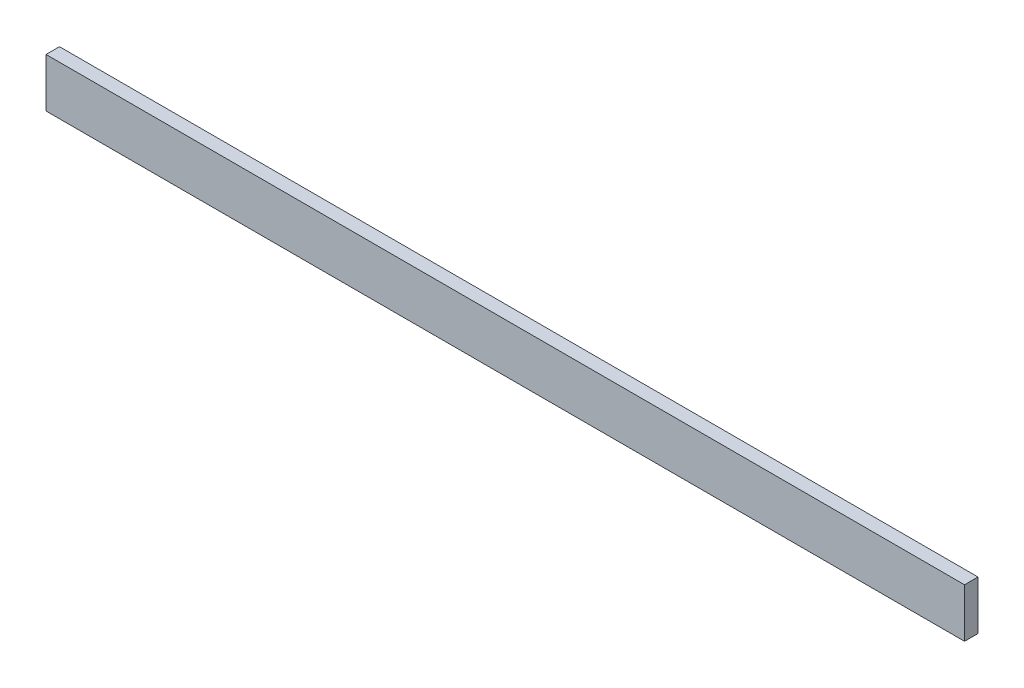
ISO-10303-21;
HEADER;
FILE_DESCRIPTION(('STEP AP214'),'2;1');
FILE_NAME('part.step','',(''),(''),'','','');
FILE_SCHEMA(('AUTOMOTIVE_DESIGN { 1 0 10303 214 1 1 1 1 }'));
ENDSEC;
DATA;
#1=APPLICATION_CONTEXT('core data for automotive mechanical design processes');
#2=APPLICATION_PROTOCOL_DEFINITION('international standard','automotive_design',2000,#1);
#3=PRODUCT_CONTEXT('',#1,'mechanical');
#4=PRODUCT('Part','Part','',(#3));
#5=PRODUCT_RELATED_PRODUCT_CATEGORY('part','',(#4));
#6=PRODUCT_DEFINITION_FORMATION('','',#4);
#7=PRODUCT_DEFINITION_CONTEXT('part definition',#1,'design');
#8=PRODUCT_DEFINITION('design','',#6,#7);
#9=PRODUCT_DEFINITION_SHAPE('','',#8);
#10=(LENGTH_UNIT() NAMED_UNIT(*) SI_UNIT(.MILLI.,.METRE.));
#11=(NAMED_UNIT(*) PLANE_ANGLE_UNIT() SI_UNIT($,.RADIAN.));
#12=(NAMED_UNIT(*) SI_UNIT($,.STERADIAN.) SOLID_ANGLE_UNIT());
#13=UNCERTAINTY_MEASURE_WITH_UNIT(LENGTH_MEASURE(1.E-05),#10,'distance_accuracy_value','');
#14=(GEOMETRIC_REPRESENTATION_CONTEXT(3) GLOBAL_UNCERTAINTY_ASSIGNED_CONTEXT((#13)) GLOBAL_UNIT_ASSIGNED_CONTEXT((#10,
#11,#12)) REPRESENTATION_CONTEXT('',''));
#15=CARTESIAN_POINT('',(0.,0.,0.));
#16=DIRECTION('',(0.,0.,1.));
#17=DIRECTION('',(1.,0.,0.));
#18=AXIS2_PLACEMENT_3D('',#15,#16,#17);
#19=CARTESIAN_POINT('',(0.,0.,22.));
#20=DIRECTION('',(1.,0.,0.));
#21=DIRECTION('',(0.,0.,-1.));
#22=AXIS2_PLACEMENT_3D('',#19,#20,#21);
#23=PLANE('',#22);
#24=DIRECTION('',(0.,-1.,0.));
#25=VECTOR('',#24,1.);
#26=CARTESIAN_POINT('',(0.,0.,0.));
#27=LINE('',#26,#25);
#28=CARTESIAN_POINT('',(0.,80.,0.));
#29=VERTEX_POINT('',#28);
#30=CARTESIAN_POINT('',(0.,0.,0.));
#31=VERTEX_POINT('',#30);
#32=EDGE_CURVE('E94',#29,#31,#27,.T.);
#33=ORIENTED_EDGE('',*,*,#32,.T.);
#34=DIRECTION('',(0.,0.,-1.));
#35=VECTOR('',#34,1.);
#36=CARTESIAN_POINT('',(0.,0.,22.));
#37=LINE('',#36,#35);
#38=CARTESIAN_POINT('',(0.,0.,22.));
#39=VERTEX_POINT('',#38);
#40=EDGE_CURVE('E11',#39,#31,#37,.T.);
#41=ORIENTED_EDGE('',*,*,#40,.F.);
#42=DIRECTION('',(0.,-1.,0.));
#43=VECTOR('',#42,1.);
#44=CARTESIAN_POINT('',(0.,0.,22.));
#45=LINE('',#44,#43);
#46=CARTESIAN_POINT('',(0.,80.,22.));
#47=VERTEX_POINT('',#46);
#48=EDGE_CURVE('E82',#47,#39,#45,.T.);
#49=ORIENTED_EDGE('',*,*,#48,.F.);
#50=DIRECTION('',(0.,0.,-1.));
#51=VECTOR('',#50,1.);
#52=CARTESIAN_POINT('',(0.,80.,22.));
#53=LINE('',#52,#51);
#54=EDGE_CURVE('E90',#47,#29,#53,.T.);
#55=ORIENTED_EDGE('',*,*,#54,.T.);
#56=EDGE_LOOP('',(#33,#41,#49,#55));
#57=FACE_BOUND('',#56,.T.);
#58=ADVANCED_FACE('F31',(#57),#23,.F.);
#59=CARTESIAN_POINT('',(0.,0.,22.));
#60=DIRECTION('',(0.,1.,0.));
#61=DIRECTION('',(0.,0.,1.));
#62=AXIS2_PLACEMENT_3D('',#59,#60,#61);
#63=PLANE('',#62);
#64=DIRECTION('',(1.,0.,0.));
#65=VECTOR('',#64,1.);
#66=CARTESIAN_POINT('',(0.,0.,0.));
#67=LINE('',#66,#65);
#68=CARTESIAN_POINT('',(1500.,0.,0.));
#69=VERTEX_POINT('',#68);
#70=EDGE_CURVE('E86',#31,#69,#67,.T.);
#71=ORIENTED_EDGE('',*,*,#70,.T.);
#72=DIRECTION('',(0.,0.,-1.));
#73=VECTOR('',#72,1.);
#74=CARTESIAN_POINT('',(1500.,0.,22.));
#75=LINE('',#74,#73);
#76=CARTESIAN_POINT('',(1500.,0.,22.));
#77=VERTEX_POINT('',#76);
#78=EDGE_CURVE('E39',#77,#69,#75,.T.);
#79=ORIENTED_EDGE('',*,*,#78,.F.);
#80=DIRECTION('',(1.,0.,0.));
#81=VECTOR('',#80,1.);
#82=CARTESIAN_POINT('',(0.,0.,22.));
#83=LINE('',#82,#81);
#84=EDGE_CURVE('E77',#39,#77,#83,.T.);
#85=ORIENTED_EDGE('',*,*,#84,.F.);
#86=ORIENTED_EDGE('',*,*,#40,.T.);
#87=EDGE_LOOP('',(#71,#79,#85,#86));
#88=FACE_BOUND('',#87,.T.);
#89=ADVANCED_FACE('F85',(#88),#63,.F.);
#90=CARTESIAN_POINT('',(1500.,0.,22.));
#91=DIRECTION('',(-1.,0.,0.));
#92=DIRECTION('',(0.,0.,1.));
#93=AXIS2_PLACEMENT_3D('',#90,#91,#92);
#94=PLANE('',#93);
#95=DIRECTION('',(0.,1.,0.));
#96=VECTOR('',#95,1.);
#97=CARTESIAN_POINT('',(1500.,0.,0.));
#98=LINE('',#97,#96);
#99=CARTESIAN_POINT('',(1500.,80.,0.));
#100=VERTEX_POINT('',#99);
#101=EDGE_CURVE('E64',#69,#100,#98,.T.);
#102=ORIENTED_EDGE('',*,*,#101,.T.);
#103=DIRECTION('',(0.,0.,-1.));
#104=VECTOR('',#103,1.);
#105=CARTESIAN_POINT('',(1500.,80.,22.));
#106=LINE('',#105,#104);
#107=CARTESIAN_POINT('',(1500.,80.,22.));
#108=VERTEX_POINT('',#107);
#109=EDGE_CURVE('E87',#108,#100,#106,.T.);
#110=ORIENTED_EDGE('',*,*,#109,.F.);
#111=DIRECTION('',(0.,1.,0.));
#112=VECTOR('',#111,1.);
#113=CARTESIAN_POINT('',(1500.,0.,22.));
#114=LINE('',#113,#112);
#115=EDGE_CURVE('E80',#77,#108,#114,.T.);
#116=ORIENTED_EDGE('',*,*,#115,.F.);
#117=ORIENTED_EDGE('',*,*,#78,.T.);
#118=EDGE_LOOP('',(#102,#110,#116,#117));
#119=FACE_BOUND('',#118,.T.);
#120=ADVANCED_FACE('F88',(#119),#94,.F.);
#121=CARTESIAN_POINT('',(0.,80.,22.));
#122=DIRECTION('',(0.,-1.,0.));
#123=DIRECTION('',(0.,0.,-1.));
#124=AXIS2_PLACEMENT_3D('',#121,#122,#123);
#125=PLANE('',#124);
#126=DIRECTION('',(-1.,0.,0.));
#127=VECTOR('',#126,1.);
#128=CARTESIAN_POINT('',(0.,80.,0.));
#129=LINE('',#128,#127);
#130=EDGE_CURVE('E70',#100,#29,#129,.T.);
#131=ORIENTED_EDGE('',*,*,#130,.T.);
#132=ORIENTED_EDGE('',*,*,#54,.F.);
#133=DIRECTION('',(-1.,0.,0.));
#134=VECTOR('',#133,1.);
#135=CARTESIAN_POINT('',(0.,80.,22.));
#136=LINE('',#135,#134);
#137=EDGE_CURVE('E47',#108,#47,#136,.T.);
#138=ORIENTED_EDGE('',*,*,#137,.F.);
#139=ORIENTED_EDGE('',*,*,#109,.T.);
#140=EDGE_LOOP('',(#131,#132,#138,#139));
#141=FACE_BOUND('',#140,.T.);
#142=ADVANCED_FACE('F101',(#141),#125,.F.);
#143=CARTESIAN_POINT('',(0.,80.,22.));
#144=DIRECTION('',(0.,0.,-1.));
#145=DIRECTION('',(-1.,0.,0.));
#146=AXIS2_PLACEMENT_3D('',#143,#144,#145);
#147=PLANE('',#146);
#148=ORIENTED_EDGE('',*,*,#48,.T.);
#149=ORIENTED_EDGE('',*,*,#84,.T.);
#150=ORIENTED_EDGE('',*,*,#115,.T.);
#151=ORIENTED_EDGE('',*,*,#137,.T.);
#152=EDGE_LOOP('',(#148,#149,#150,#151));
#153=FACE_BOUND('',#152,.T.);
#154=ADVANCED_FACE('F78',(#153),#147,.F.);
#155=CARTESIAN_POINT('',(0.,80.,0.));
#156=DIRECTION('',(0.,0.,-1.));
#157=DIRECTION('',(-1.,0.,0.));
#158=AXIS2_PLACEMENT_3D('',#155,#156,#157);
#159=PLANE('',#158);
#160=ORIENTED_EDGE('',*,*,#32,.F.);
#161=ORIENTED_EDGE('',*,*,#130,.F.);
#162=ORIENTED_EDGE('',*,*,#101,.F.);
#163=ORIENTED_EDGE('',*,*,#70,.F.);
#164=EDGE_LOOP('',(#160,#161,#162,#163));
#165=FACE_BOUND('',#164,.T.);
#166=ADVANCED_FACE('F104',(#165),#159,.T.);
#167=CLOSED_SHELL('',(#58,#89,#120,#142,#154,#166));
#168=MANIFOLD_SOLID_BREP('B2',#167);
#169=ADVANCED_BREP_SHAPE_REPRESENTATION('',(#18,#168),#14);
#170=SHAPE_DEFINITION_REPRESENTATION(#9,#169);
ENDSEC;
END-ISO-10303-21;
